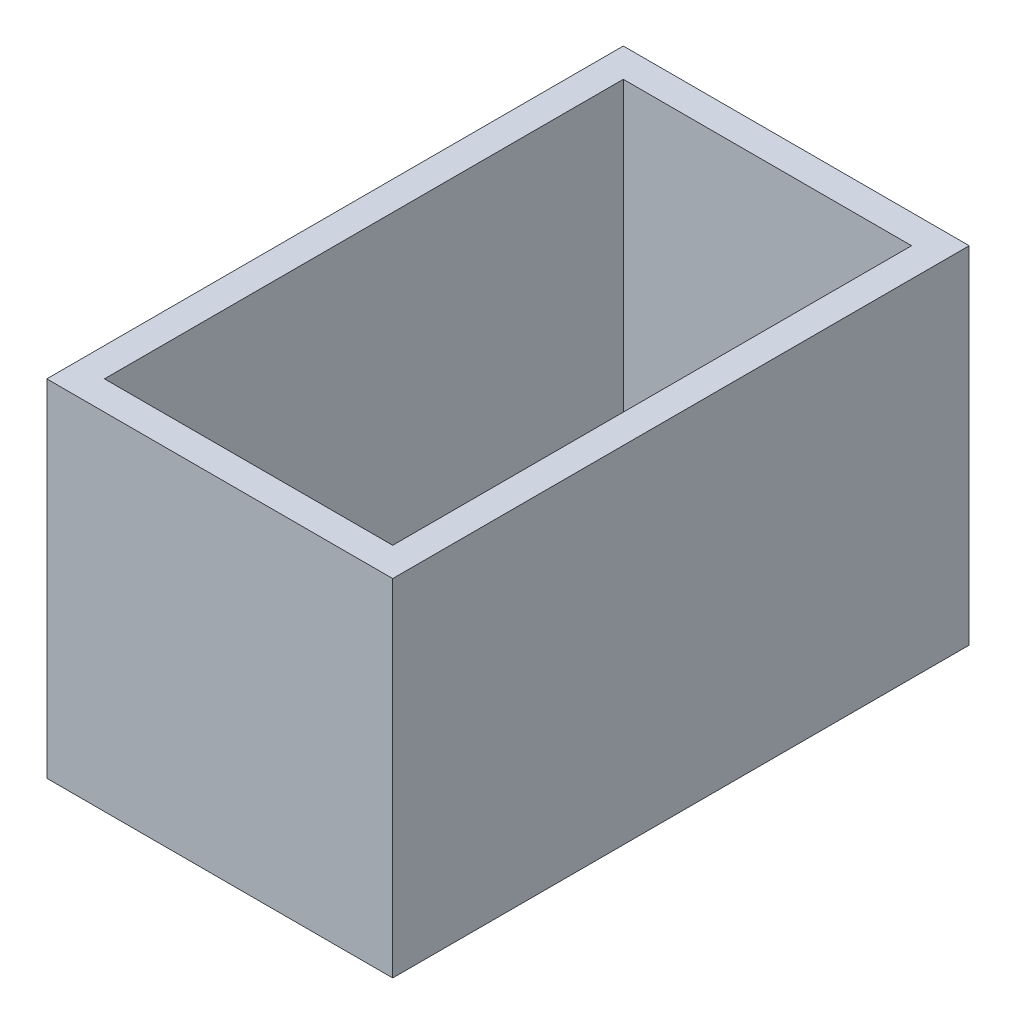
ISO-10303-21;
HEADER;
FILE_DESCRIPTION(('STEP AP214'),'2;1');
FILE_NAME('part.step','',(''),(''),'','','');
FILE_SCHEMA(('AUTOMOTIVE_DESIGN { 1 0 10303 214 1 1 1 1 }'));
ENDSEC;
DATA;
#1=APPLICATION_CONTEXT('core data for automotive mechanical design processes');
#2=APPLICATION_PROTOCOL_DEFINITION('international standard','automotive_design',2000,#1);
#3=PRODUCT_CONTEXT('',#1,'mechanical');
#4=PRODUCT('Part','Part','',(#3));
#5=PRODUCT_RELATED_PRODUCT_CATEGORY('part','',(#4));
#6=PRODUCT_DEFINITION_FORMATION('','',#4);
#7=PRODUCT_DEFINITION_CONTEXT('part definition',#1,'design');
#8=PRODUCT_DEFINITION('design','',#6,#7);
#9=PRODUCT_DEFINITION_SHAPE('','',#8);
#10=(LENGTH_UNIT() NAMED_UNIT(*) SI_UNIT(.MILLI.,.METRE.));
#11=(NAMED_UNIT(*) PLANE_ANGLE_UNIT() SI_UNIT($,.RADIAN.));
#12=(NAMED_UNIT(*) SI_UNIT($,.STERADIAN.) SOLID_ANGLE_UNIT());
#13=UNCERTAINTY_MEASURE_WITH_UNIT(LENGTH_MEASURE(1.E-05),#10,'distance_accuracy_value','');
#14=(GEOMETRIC_REPRESENTATION_CONTEXT(3) GLOBAL_UNCERTAINTY_ASSIGNED_CONTEXT((#13)) GLOBAL_UNIT_ASSIGNED_CONTEXT((#10,
#11,#12)) REPRESENTATION_CONTEXT('',''));
#15=CARTESIAN_POINT('',(0.,0.,0.));
#16=DIRECTION('',(0.,0.,1.));
#17=DIRECTION('',(1.,0.,0.));
#18=AXIS2_PLACEMENT_3D('',#15,#16,#17);
#19=CARTESIAN_POINT('',(0.,76.2,-127.));
#20=DIRECTION('',(1.,0.,0.));
#21=DIRECTION('',(0.,0.,-1.));
#22=AXIS2_PLACEMENT_3D('',#19,#20,#21);
#23=PLANE('',#22);
#24=DIRECTION('',(0.,0.,1.));
#25=VECTOR('',#24,1.);
#26=CARTESIAN_POINT('',(0.,0.,-127.));
#27=LINE('',#26,#25);
#28=CARTESIAN_POINT('',(0.,0.,-127.));
#29=VERTEX_POINT('',#28);
#30=CARTESIAN_POINT('',(0.,0.,0.));
#31=VERTEX_POINT('',#30);
#32=EDGE_CURVE('E149',#29,#31,#27,.T.);
#33=ORIENTED_EDGE('',*,*,#32,.T.);
#34=DIRECTION('',(0.,-1.,0.));
#35=VECTOR('',#34,1.);
#36=CARTESIAN_POINT('',(0.,76.2,0.));
#37=LINE('',#36,#35);
#38=CARTESIAN_POINT('',(0.,76.2,0.));
#39=VERTEX_POINT('',#38);
#40=EDGE_CURVE('E11',#39,#31,#37,.T.);
#41=ORIENTED_EDGE('',*,*,#40,.F.);
#42=DIRECTION('',(0.,0.,1.));
#43=VECTOR('',#42,1.);
#44=CARTESIAN_POINT('',(0.,76.2,-127.));
#45=LINE('',#44,#43);
#46=CARTESIAN_POINT('',(0.,76.2,-127.));
#47=VERTEX_POINT('',#46);
#48=EDGE_CURVE('E142',#47,#39,#45,.T.);
#49=ORIENTED_EDGE('',*,*,#48,.F.);
#50=DIRECTION('',(0.,-1.,0.));
#51=VECTOR('',#50,1.);
#52=CARTESIAN_POINT('',(0.,76.2,-127.));
#53=LINE('',#52,#51);
#54=EDGE_CURVE('E148',#47,#29,#53,.T.);
#55=ORIENTED_EDGE('',*,*,#54,.T.);
#56=EDGE_LOOP('',(#33,#41,#49,#55));
#57=FACE_BOUND('',#56,.T.);
#58=ADVANCED_FACE('F35',(#57),#23,.F.);
#59=CARTESIAN_POINT('',(0.,76.2,0.));
#60=DIRECTION('',(0.,0.,-1.));
#61=DIRECTION('',(-1.,0.,0.));
#62=AXIS2_PLACEMENT_3D('',#59,#60,#61);
#63=PLANE('',#62);
#64=DIRECTION('',(1.,0.,0.));
#65=VECTOR('',#64,1.);
#66=CARTESIAN_POINT('',(0.,0.,0.));
#67=LINE('',#66,#65);
#68=CARTESIAN_POINT('',(76.2,0.,0.));
#69=VERTEX_POINT('',#68);
#70=EDGE_CURVE('E152',#31,#69,#67,.T.);
#71=ORIENTED_EDGE('',*,*,#70,.T.);
#72=DIRECTION('',(0.,-1.,0.));
#73=VECTOR('',#72,1.);
#74=CARTESIAN_POINT('',(76.2,76.2,0.));
#75=LINE('',#74,#73);
#76=CARTESIAN_POINT('',(76.2,76.2,0.));
#77=VERTEX_POINT('',#76);
#78=EDGE_CURVE('E42',#77,#69,#75,.T.);
#79=ORIENTED_EDGE('',*,*,#78,.F.);
#80=DIRECTION('',(1.,0.,0.));
#81=VECTOR('',#80,1.);
#82=CARTESIAN_POINT('',(0.,76.2,0.));
#83=LINE('',#82,#81);
#84=EDGE_CURVE('E86',#39,#77,#83,.T.);
#85=ORIENTED_EDGE('',*,*,#84,.F.);
#86=ORIENTED_EDGE('',*,*,#40,.T.);
#87=EDGE_LOOP('',(#71,#79,#85,#86));
#88=FACE_BOUND('',#87,.T.);
#89=ADVANCED_FACE('F181',(#88),#63,.F.);
#90=CARTESIAN_POINT('',(76.2,76.2,-127.));
#91=DIRECTION('',(-1.,0.,0.));
#92=DIRECTION('',(0.,0.,1.));
#93=AXIS2_PLACEMENT_3D('',#90,#91,#92);
#94=PLANE('',#93);
#95=DIRECTION('',(0.,0.,-1.));
#96=VECTOR('',#95,1.);
#97=CARTESIAN_POINT('',(76.2,0.,-127.));
#98=LINE('',#97,#96);
#99=CARTESIAN_POINT('',(76.2,0.,-127.));
#100=VERTEX_POINT('',#99);
#101=EDGE_CURVE('E154',#69,#100,#98,.T.);
#102=ORIENTED_EDGE('',*,*,#101,.T.);
#103=DIRECTION('',(0.,-1.,0.));
#104=VECTOR('',#103,1.);
#105=CARTESIAN_POINT('',(76.2,76.2,-127.));
#106=LINE('',#105,#104);
#107=CARTESIAN_POINT('',(76.2,76.2,-127.));
#108=VERTEX_POINT('',#107);
#109=EDGE_CURVE('E158',#108,#100,#106,.T.);
#110=ORIENTED_EDGE('',*,*,#109,.F.);
#111=DIRECTION('',(0.,0.,-1.));
#112=VECTOR('',#111,1.);
#113=CARTESIAN_POINT('',(76.2,76.2,-127.));
#114=LINE('',#113,#112);
#115=EDGE_CURVE('E145',#77,#108,#114,.T.);
#116=ORIENTED_EDGE('',*,*,#115,.F.);
#117=ORIENTED_EDGE('',*,*,#78,.T.);
#118=EDGE_LOOP('',(#102,#110,#116,#117));
#119=FACE_BOUND('',#118,.T.);
#120=ADVANCED_FACE('F163',(#119),#94,.F.);
#121=CARTESIAN_POINT('',(0.,76.2,-127.));
#122=DIRECTION('',(0.,0.,1.));
#123=DIRECTION('',(1.,0.,0.));
#124=AXIS2_PLACEMENT_3D('',#121,#122,#123);
#125=PLANE('',#124);
#126=DIRECTION('',(-1.,0.,0.));
#127=VECTOR('',#126,1.);
#128=CARTESIAN_POINT('',(0.,0.,-127.));
#129=LINE('',#128,#127);
#130=EDGE_CURVE('E79',#100,#29,#129,.T.);
#131=ORIENTED_EDGE('',*,*,#130,.T.);
#132=ORIENTED_EDGE('',*,*,#54,.F.);
#133=DIRECTION('',(-1.,0.,0.));
#134=VECTOR('',#133,1.);
#135=CARTESIAN_POINT('',(0.,76.2,-127.));
#136=LINE('',#135,#134);
#137=EDGE_CURVE('E58',#108,#47,#136,.T.);
#138=ORIENTED_EDGE('',*,*,#137,.F.);
#139=ORIENTED_EDGE('',*,*,#109,.T.);
#140=EDGE_LOOP('',(#131,#132,#138,#139));
#141=FACE_BOUND('',#140,.T.);
#142=ADVANCED_FACE('F171',(#141),#125,.F.);
#143=CARTESIAN_POINT('',(0.,76.2,0.));
#144=DIRECTION('',(0.,1.,0.));
#145=DIRECTION('',(0.,0.,1.));
#146=AXIS2_PLACEMENT_3D('',#143,#144,#145);
#147=PLANE('',#146);
#148=DIRECTION('',(0.,0.,1.));
#149=VECTOR('',#148,1.);
#150=CARTESIAN_POINT('',(6.34999999999999,76.2,-127.));
#151=LINE('',#150,#149);
#152=CARTESIAN_POINT('',(6.34999999999999,76.2,-120.65));
#153=VERTEX_POINT('',#152);
#154=CARTESIAN_POINT('',(6.35,76.2,-6.35));
#155=VERTEX_POINT('',#154);
#156=EDGE_CURVE('E131',#153,#155,#151,.T.);
#157=ORIENTED_EDGE('',*,*,#156,.F.);
#158=DIRECTION('',(-1.,0.,0.));
#159=VECTOR('',#158,1.);
#160=CARTESIAN_POINT('',(0.,76.2,-120.65));
#161=LINE('',#160,#159);
#162=CARTESIAN_POINT('',(69.85,76.2,-120.65));
#163=VERTEX_POINT('',#162);
#164=EDGE_CURVE('E140',#163,#153,#161,.T.);
#165=ORIENTED_EDGE('',*,*,#164,.F.);
#166=DIRECTION('',(0.,0.,-1.));
#167=VECTOR('',#166,1.);
#168=CARTESIAN_POINT('',(69.85,76.2,-127.));
#169=LINE('',#168,#167);
#170=CARTESIAN_POINT('',(69.85,76.2,-6.35));
#171=VERTEX_POINT('',#170);
#172=EDGE_CURVE('E138',#171,#163,#169,.T.);
#173=ORIENTED_EDGE('',*,*,#172,.F.);
#174=DIRECTION('',(1.,0.,0.));
#175=VECTOR('',#174,1.);
#176=CARTESIAN_POINT('',(0.,76.2,-6.35));
#177=LINE('',#176,#175);
#178=EDGE_CURVE('E123',#155,#171,#177,.T.);
#179=ORIENTED_EDGE('',*,*,#178,.F.);
#180=EDGE_LOOP('',(#157,#165,#173,#179));
#181=FACE_BOUND('',#180,.T.);
#182=ORIENTED_EDGE('',*,*,#48,.T.);
#183=ORIENTED_EDGE('',*,*,#84,.T.);
#184=ORIENTED_EDGE('',*,*,#115,.T.);
#185=ORIENTED_EDGE('',*,*,#137,.T.);
#186=EDGE_LOOP('',(#182,#183,#184,#185));
#187=FACE_BOUND('',#186,.T.);
#188=ADVANCED_FACE('F173',(#181,#187),#147,.T.);
#189=CARTESIAN_POINT('',(0.,0.,0.));
#190=DIRECTION('',(0.,1.,0.));
#191=DIRECTION('',(0.,0.,1.));
#192=AXIS2_PLACEMENT_3D('',#189,#190,#191);
#193=PLANE('',#192);
#194=ORIENTED_EDGE('',*,*,#32,.F.);
#195=ORIENTED_EDGE('',*,*,#130,.F.);
#196=ORIENTED_EDGE('',*,*,#101,.F.);
#197=ORIENTED_EDGE('',*,*,#70,.F.);
#198=EDGE_LOOP('',(#194,#195,#196,#197));
#199=FACE_BOUND('',#198,.T.);
#200=ADVANCED_FACE('F167',(#199),#193,.F.);
#201=CARTESIAN_POINT('',(6.34999999999999,76.2,-127.));
#202=DIRECTION('',(1.,0.,0.));
#203=DIRECTION('',(0.,0.,-1.));
#204=AXIS2_PLACEMENT_3D('',#201,#202,#203);
#205=PLANE('',#204);
#206=DIRECTION('',(0.,0.,1.));
#207=VECTOR('',#206,1.);
#208=CARTESIAN_POINT('',(6.34999999999999,6.34999999999999,-127.));
#209=LINE('',#208,#207);
#210=CARTESIAN_POINT('',(6.34999999999999,6.35,-120.65));
#211=VERTEX_POINT('',#210);
#212=CARTESIAN_POINT('',(6.35,6.35,-6.35));
#213=VERTEX_POINT('',#212);
#214=EDGE_CURVE('E114',#211,#213,#209,.T.);
#215=ORIENTED_EDGE('',*,*,#214,.F.);
#216=DIRECTION('',(0.,-1.,0.));
#217=VECTOR('',#216,1.);
#218=CARTESIAN_POINT('',(6.34999999999999,76.2,-120.65));
#219=LINE('',#218,#217);
#220=EDGE_CURVE('E134',#153,#211,#219,.T.);
#221=ORIENTED_EDGE('',*,*,#220,.F.);
#222=ORIENTED_EDGE('',*,*,#156,.T.);
#223=DIRECTION('',(0.,-1.,0.));
#224=VECTOR('',#223,1.);
#225=CARTESIAN_POINT('',(6.35,76.2,-6.35));
#226=LINE('',#225,#224);
#227=EDGE_CURVE('E126',#155,#213,#226,.T.);
#228=ORIENTED_EDGE('',*,*,#227,.T.);
#229=EDGE_LOOP('',(#215,#221,#222,#228));
#230=FACE_BOUND('',#229,.T.);
#231=ADVANCED_FACE('F208',(#230),#205,.T.);
#232=CARTESIAN_POINT('',(0.,76.2,-6.35));
#233=DIRECTION('',(0.,0.,-1.));
#234=DIRECTION('',(-1.,0.,0.));
#235=AXIS2_PLACEMENT_3D('',#232,#233,#234);
#236=PLANE('',#235);
#237=DIRECTION('',(1.,0.,0.));
#238=VECTOR('',#237,1.);
#239=CARTESIAN_POINT('',(0.,6.34999999999999,-6.35));
#240=LINE('',#239,#238);
#241=CARTESIAN_POINT('',(69.85,6.35,-6.35));
#242=VERTEX_POINT('',#241);
#243=EDGE_CURVE('E108',#213,#242,#240,.T.);
#244=ORIENTED_EDGE('',*,*,#243,.F.);
#245=ORIENTED_EDGE('',*,*,#227,.F.);
#246=ORIENTED_EDGE('',*,*,#178,.T.);
#247=DIRECTION('',(0.,-1.,0.));
#248=VECTOR('',#247,1.);
#249=CARTESIAN_POINT('',(69.85,76.2,-6.34999999999999));
#250=LINE('',#249,#248);
#251=EDGE_CURVE('E120',#171,#242,#250,.T.);
#252=ORIENTED_EDGE('',*,*,#251,.T.);
#253=EDGE_LOOP('',(#244,#245,#246,#252));
#254=FACE_BOUND('',#253,.T.);
#255=ADVANCED_FACE('F121',(#254),#236,.T.);
#256=CARTESIAN_POINT('',(69.85,76.2,-127.));
#257=DIRECTION('',(-1.,0.,0.));
#258=DIRECTION('',(0.,0.,1.));
#259=AXIS2_PLACEMENT_3D('',#256,#257,#258);
#260=PLANE('',#259);
#261=DIRECTION('',(0.,0.,-1.));
#262=VECTOR('',#261,1.);
#263=CARTESIAN_POINT('',(69.85,6.34999999999999,-127.));
#264=LINE('',#263,#262);
#265=CARTESIAN_POINT('',(69.85,6.35,-120.65));
#266=VERTEX_POINT('',#265);
#267=EDGE_CURVE('E112',#242,#266,#264,.T.);
#268=ORIENTED_EDGE('',*,*,#267,.F.);
#269=ORIENTED_EDGE('',*,*,#251,.F.);
#270=ORIENTED_EDGE('',*,*,#172,.T.);
#271=DIRECTION('',(0.,-1.,0.));
#272=VECTOR('',#271,1.);
#273=CARTESIAN_POINT('',(69.85,76.2,-120.65));
#274=LINE('',#273,#272);
#275=EDGE_CURVE('E49',#163,#266,#274,.T.);
#276=ORIENTED_EDGE('',*,*,#275,.T.);
#277=EDGE_LOOP('',(#268,#269,#270,#276));
#278=FACE_BOUND('',#277,.T.);
#279=ADVANCED_FACE('F128',(#278),#260,.T.);
#280=CARTESIAN_POINT('',(0.,76.2,-120.65));
#281=DIRECTION('',(0.,0.,1.));
#282=DIRECTION('',(1.,0.,0.));
#283=AXIS2_PLACEMENT_3D('',#280,#281,#282);
#284=PLANE('',#283);
#285=DIRECTION('',(-1.,0.,0.));
#286=VECTOR('',#285,1.);
#287=CARTESIAN_POINT('',(0.,6.34999999999999,-120.65));
#288=LINE('',#287,#286);
#289=EDGE_CURVE('E129',#266,#211,#288,.T.);
#290=ORIENTED_EDGE('',*,*,#289,.F.);
#291=ORIENTED_EDGE('',*,*,#275,.F.);
#292=ORIENTED_EDGE('',*,*,#164,.T.);
#293=ORIENTED_EDGE('',*,*,#220,.T.);
#294=EDGE_LOOP('',(#290,#291,#292,#293));
#295=FACE_BOUND('',#294,.T.);
#296=ADVANCED_FACE('F238',(#295),#284,.T.);
#297=CARTESIAN_POINT('',(0.,6.35,0.));
#298=DIRECTION('',(0.,1.,0.));
#299=DIRECTION('',(0.,0.,1.));
#300=AXIS2_PLACEMENT_3D('',#297,#298,#299);
#301=PLANE('',#300);
#302=ORIENTED_EDGE('',*,*,#214,.T.);
#303=ORIENTED_EDGE('',*,*,#243,.T.);
#304=ORIENTED_EDGE('',*,*,#267,.T.);
#305=ORIENTED_EDGE('',*,*,#289,.T.);
#306=EDGE_LOOP('',(#302,#303,#304,#305));
#307=FACE_BOUND('',#306,.T.);
#308=ADVANCED_FACE('F110',(#307),#301,.T.);
#309=CLOSED_SHELL('',(#58,#89,#120,#142,#188,#200,#231,#255,#279,#296,#308));
#310=MANIFOLD_SOLID_BREP('B2',#309);
#311=ADVANCED_BREP_SHAPE_REPRESENTATION('',(#18,#310),#14);
#312=SHAPE_DEFINITION_REPRESENTATION(#9,#311);
ENDSEC;
END-ISO-10303-21;
